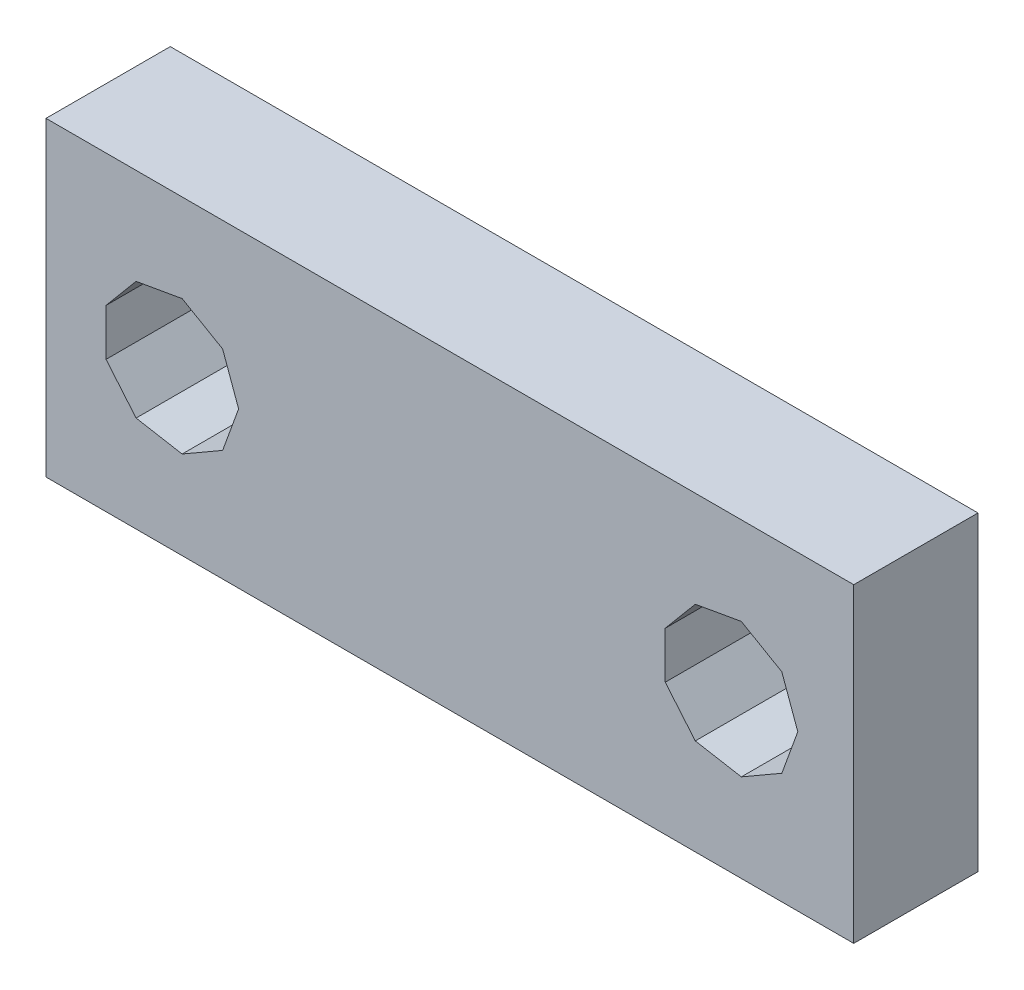
ISO-10303-21;
HEADER;
FILE_DESCRIPTION(('STEP AP214'),'2;1');
FILE_NAME('part.step','',(''),(''),'','','');
FILE_SCHEMA(('AUTOMOTIVE_DESIGN { 1 0 10303 214 1 1 1 1 }'));
ENDSEC;
DATA;
#1=APPLICATION_CONTEXT('core data for automotive mechanical design processes');
#2=APPLICATION_PROTOCOL_DEFINITION('international standard','automotive_design',2000,#1);
#3=PRODUCT_CONTEXT('',#1,'mechanical');
#4=PRODUCT('Part','Part','',(#3));
#5=PRODUCT_RELATED_PRODUCT_CATEGORY('part','',(#4));
#6=PRODUCT_DEFINITION_FORMATION('','',#4);
#7=PRODUCT_DEFINITION_CONTEXT('part definition',#1,'design');
#8=PRODUCT_DEFINITION('design','',#6,#7);
#9=PRODUCT_DEFINITION_SHAPE('','',#8);
#10=(LENGTH_UNIT() NAMED_UNIT(*) SI_UNIT(.MILLI.,.METRE.));
#11=(NAMED_UNIT(*) PLANE_ANGLE_UNIT() SI_UNIT($,.RADIAN.));
#12=(NAMED_UNIT(*) SI_UNIT($,.STERADIAN.) SOLID_ANGLE_UNIT());
#13=UNCERTAINTY_MEASURE_WITH_UNIT(LENGTH_MEASURE(1.E-05),#10,'distance_accuracy_value','');
#14=(GEOMETRIC_REPRESENTATION_CONTEXT(3) GLOBAL_UNCERTAINTY_ASSIGNED_CONTEXT((#13)) GLOBAL_UNIT_ASSIGNED_CONTEXT((#10,
#11,#12)) REPRESENTATION_CONTEXT('',''));
#15=CARTESIAN_POINT('',(0.,0.,0.));
#16=DIRECTION('',(0.,0.,1.));
#17=DIRECTION('',(1.,0.,0.));
#18=AXIS2_PLACEMENT_3D('',#15,#16,#17);
#19=CARTESIAN_POINT('',(0.,0.,4.));
#20=DIRECTION('',(0.,0.,1.));
#21=DIRECTION('',(1.,0.,0.));
#22=AXIS2_PLACEMENT_3D('',#19,#20,#21);
#23=PLANE('',#22);
#24=DIRECTION('',(0.,-1.,0.));
#25=VECTOR('',#24,1.);
#26=CARTESIAN_POINT('',(0.,10.,4.));
#27=LINE('',#26,#25);
#28=CARTESIAN_POINT('',(0.,10.,4.));
#29=VERTEX_POINT('',#28);
#30=CARTESIAN_POINT('',(0.,0.,4.));
#31=VERTEX_POINT('',#30);
#32=EDGE_CURVE('E320',#29,#31,#27,.T.);
#33=ORIENTED_EDGE('',*,*,#32,.T.);
#34=DIRECTION('',(1.,0.,0.));
#35=VECTOR('',#34,1.);
#36=CARTESIAN_POINT('',(0.,0.,4.));
#37=LINE('',#36,#35);
#38=CARTESIAN_POINT('',(26.,0.,4.));
#39=VERTEX_POINT('',#38);
#40=EDGE_CURVE('E323',#31,#39,#37,.T.);
#41=ORIENTED_EDGE('',*,*,#40,.T.);
#42=DIRECTION('',(0.,1.,0.));
#43=VECTOR('',#42,1.);
#44=CARTESIAN_POINT('',(26.,10.,4.));
#45=LINE('',#44,#43);
#46=CARTESIAN_POINT('',(26.,10.,4.));
#47=VERTEX_POINT('',#46);
#48=EDGE_CURVE('E326',#39,#47,#45,.T.);
#49=ORIENTED_EDGE('',*,*,#48,.T.);
#50=DIRECTION('',(-1.,0.,0.));
#51=VECTOR('',#50,1.);
#52=CARTESIAN_POINT('',(0.,10.,4.));
#53=LINE('',#52,#51);
#54=EDGE_CURVE('E328',#47,#29,#53,.T.);
#55=ORIENTED_EDGE('',*,*,#54,.T.);
#56=EDGE_LOOP('',(#33,#41,#49,#55));
#57=FACE_BOUND('',#56,.T.);
#58=DIRECTION('',(0.,-1.,0.));
#59=VECTOR('',#58,1.);
#60=CARTESIAN_POINT('',(1.93267600801389,4.24755567239836,4.));
#61=LINE('',#60,#59);
#62=CARTESIAN_POINT('',(1.93267600801389,5.75244442974977,4.));
#63=VERTEX_POINT('',#62);
#64=CARTESIAN_POINT('',(1.93267600801389,4.24755567239836,4.));
#65=VERTEX_POINT('',#64);
#66=EDGE_CURVE('E256',#63,#65,#61,.T.);
#67=ORIENTED_EDGE('',*,*,#66,.F.);
#68=DIRECTION('',(-0.642787606856775,-0.766044445493432,0.));
#69=VECTOR('',#68,1.);
#70=CARTESIAN_POINT('',(1.93267600801389,5.75244442974977,4.));
#71=LINE('',#70,#69);
#72=CARTESIAN_POINT('',(2.89999985093747,6.90525610340432,4.));
#73=VERTEX_POINT('',#72);
#74=EDGE_CURVE('E254',#73,#63,#71,.T.);
#75=ORIENTED_EDGE('',*,*,#74,.F.);
#76=DIRECTION('',(-0.984807774919369,-0.173648053425202,0.));
#77=VECTOR('',#76,1.);
#78=CARTESIAN_POINT('',(2.89999985093747,6.90525610340432,4.));
#79=LINE('',#78,#77);
#80=CARTESIAN_POINT('',(4.38202599956588,7.16657710673986,4.));
#81=VERTEX_POINT('',#80);
#82=EDGE_CURVE('E272',#81,#73,#79,.T.);
#83=ORIENTED_EDGE('',*,*,#82,.F.);
#84=DIRECTION('',(-0.866025520884857,0.499999797176071,0.));
#85=VECTOR('',#84,1.);
#86=CARTESIAN_POINT('',(4.38202599956588,7.16657710673986,4.));
#87=LINE('',#86,#85);
#88=CARTESIAN_POINT('',(5.68529806952489,6.41413303329161,4.));
#89=VERTEX_POINT('',#88);
#90=EDGE_CURVE('E269',#89,#81,#87,.T.);
#91=ORIENTED_EDGE('',*,*,#90,.F.);
#92=DIRECTION('',(-0.342019920899004,0.939692701742564,0.));
#93=VECTOR('',#92,1.);
#94=CARTESIAN_POINT('',(5.68529806952489,6.41413303329161,4.));
#95=LINE('',#94,#93);
#96=CARTESIAN_POINT('',(6.20000000327602,5.00000005107406,4.));
#97=VERTEX_POINT('',#96);
#98=EDGE_CURVE('E267',#97,#89,#95,.T.);
#99=ORIENTED_EDGE('',*,*,#98,.F.);
#100=DIRECTION('',(0.342019920899004,0.939692701742564,0.));
#101=VECTOR('',#100,1.);
#102=CARTESIAN_POINT('',(6.20000000327602,5.00000005107406,4.));
#103=LINE('',#102,#101);
#104=CARTESIAN_POINT('',(5.68529806952489,3.58586706885652,4.));
#105=VERTEX_POINT('',#104);
#106=EDGE_CURVE('E265',#105,#97,#103,.T.);
#107=ORIENTED_EDGE('',*,*,#106,.F.);
#108=DIRECTION('',(0.866025520884857,0.499999797176071,0.));
#109=VECTOR('',#108,1.);
#110=CARTESIAN_POINT('',(5.68529806952489,3.58586706885652,4.));
#111=LINE('',#110,#109);
#112=CARTESIAN_POINT('',(4.38202599956588,2.83342299540827,4.));
#113=VERTEX_POINT('',#112);
#114=EDGE_CURVE('E263',#113,#105,#111,.T.);
#115=ORIENTED_EDGE('',*,*,#114,.F.);
#116=DIRECTION('',(0.984807774919369,-0.173648053425203,0.));
#117=VECTOR('',#116,1.);
#118=CARTESIAN_POINT('',(4.38202599956588,2.83342299540827,4.));
#119=LINE('',#118,#117);
#120=CARTESIAN_POINT('',(2.89999985093747,3.09474399874381,4.));
#121=VERTEX_POINT('',#120);
#122=EDGE_CURVE('E261',#121,#113,#119,.T.);
#123=ORIENTED_EDGE('',*,*,#122,.F.);
#124=DIRECTION('',(0.642787606856775,-0.766044445493432,0.));
#125=VECTOR('',#124,1.);
#126=CARTESIAN_POINT('',(2.89999985093747,3.09474399874381,4.));
#127=LINE('',#126,#125);
#128=EDGE_CURVE('E259',#65,#121,#127,.T.);
#129=ORIENTED_EDGE('',*,*,#128,.F.);
#130=EDGE_LOOP('',(#67,#75,#83,#91,#99,#107,#115,#123,#129));
#131=FACE_BOUND('',#130,.T.);
#132=DIRECTION('',(0.,-1.,0.));
#133=VECTOR('',#132,1.);
#134=CARTESIAN_POINT('',(19.9326760047203,4.24755567239836,4.));
#135=LINE('',#134,#133);
#136=CARTESIAN_POINT('',(19.9326760047203,5.75244442974977,4.));
#137=VERTEX_POINT('',#136);
#138=CARTESIAN_POINT('',(19.9326760047203,4.24755567239836,4.));
#139=VERTEX_POINT('',#138);
#140=EDGE_CURVE('E190',#137,#139,#135,.T.);
#141=ORIENTED_EDGE('',*,*,#140,.F.);
#142=DIRECTION('',(-0.642787606856775,-0.766044445493432,0.));
#143=VECTOR('',#142,1.);
#144=CARTESIAN_POINT('',(19.9326760047203,5.75244442974977,4.));
#145=LINE('',#144,#143);
#146=CARTESIAN_POINT('',(20.8999998476439,6.90525610340432,4.));
#147=VERTEX_POINT('',#146);
#148=EDGE_CURVE('E182',#147,#137,#145,.T.);
#149=ORIENTED_EDGE('',*,*,#148,.F.);
#150=DIRECTION('',(-0.984807774919369,-0.173648053425202,0.));
#151=VECTOR('',#150,1.);
#152=CARTESIAN_POINT('',(20.8999998476439,6.90525610340432,4.));
#153=LINE('',#152,#151);
#154=CARTESIAN_POINT('',(22.3820259962723,7.16657710673987,4.));
#155=VERTEX_POINT('',#154);
#156=EDGE_CURVE('E217',#155,#147,#153,.T.);
#157=ORIENTED_EDGE('',*,*,#156,.F.);
#158=DIRECTION('',(-0.866025520884857,0.499999797176071,0.));
#159=VECTOR('',#158,1.);
#160=CARTESIAN_POINT('',(22.3820259962723,7.16657710673986,4.));
#161=LINE('',#160,#159);
#162=CARTESIAN_POINT('',(23.6852980662313,6.41413303329161,4.));
#163=VERTEX_POINT('',#162);
#164=EDGE_CURVE('E215',#163,#155,#161,.T.);
#165=ORIENTED_EDGE('',*,*,#164,.F.);
#166=DIRECTION('',(-0.342019920899003,0.939692701742564,0.));
#167=VECTOR('',#166,1.);
#168=CARTESIAN_POINT('',(23.6852980662313,6.41413303329161,4.));
#169=LINE('',#168,#167);
#170=CARTESIAN_POINT('',(24.1999999999825,5.00000005107406,4.));
#171=VERTEX_POINT('',#170);
#172=EDGE_CURVE('E213',#171,#163,#169,.T.);
#173=ORIENTED_EDGE('',*,*,#172,.F.);
#174=DIRECTION('',(0.342019920899002,0.939692701742564,0.));
#175=VECTOR('',#174,1.);
#176=CARTESIAN_POINT('',(24.1999999999825,5.00000005107406,4.));
#177=LINE('',#176,#175);
#178=CARTESIAN_POINT('',(23.6852980662313,3.58586706885652,4.));
#179=VERTEX_POINT('',#178);
#180=EDGE_CURVE('E211',#179,#171,#177,.T.);
#181=ORIENTED_EDGE('',*,*,#180,.F.);
#182=DIRECTION('',(0.866025520884857,0.499999797176071,0.));
#183=VECTOR('',#182,1.);
#184=CARTESIAN_POINT('',(23.6852980662313,3.58586706885652,4.));
#185=LINE('',#184,#183);
#186=CARTESIAN_POINT('',(22.3820259962723,2.83342299540827,4.));
#187=VERTEX_POINT('',#186);
#188=EDGE_CURVE('E209',#187,#179,#185,.T.);
#189=ORIENTED_EDGE('',*,*,#188,.F.);
#190=DIRECTION('',(0.984807774919369,-0.173648053425203,0.));
#191=VECTOR('',#190,1.);
#192=CARTESIAN_POINT('',(22.3820259962723,2.83342299540827,4.));
#193=LINE('',#192,#191);
#194=CARTESIAN_POINT('',(20.8999998476439,3.09474399874381,4.));
#195=VERTEX_POINT('',#194);
#196=EDGE_CURVE('E205',#195,#187,#193,.T.);
#197=ORIENTED_EDGE('',*,*,#196,.F.);
#198=DIRECTION('',(0.642787606856775,-0.766044445493432,0.));
#199=VECTOR('',#198,1.);
#200=CARTESIAN_POINT('',(20.8999998476439,3.09474399874381,4.));
#201=LINE('',#200,#199);
#202=EDGE_CURVE('E203',#139,#195,#201,.T.);
#203=ORIENTED_EDGE('',*,*,#202,.F.);
#204=EDGE_LOOP('',(#141,#149,#157,#165,#173,#181,#189,#197,#203));
#205=FACE_BOUND('',#204,.T.);
#206=ADVANCED_FACE('F33',(#57,#131,#205),#23,.T.);
#207=CARTESIAN_POINT('',(0.,0.,0.));
#208=DIRECTION('',(0.,0.,1.));
#209=DIRECTION('',(1.,0.,0.));
#210=AXIS2_PLACEMENT_3D('',#207,#208,#209);
#211=PLANE('',#210);
#212=DIRECTION('',(-0.642787606856775,-0.766044445493432,0.));
#213=VECTOR('',#212,1.);
#214=CARTESIAN_POINT('',(1.93267600801389,5.75244442974977,0.));
#215=LINE('',#214,#213);
#216=CARTESIAN_POINT('',(2.89999985093747,6.90525610340432,0.));
#217=VERTEX_POINT('',#216);
#218=CARTESIAN_POINT('',(1.93267600801389,5.75244442974977,0.));
#219=VERTEX_POINT('',#218);
#220=EDGE_CURVE('E198',#217,#219,#215,.T.);
#221=ORIENTED_EDGE('',*,*,#220,.T.);
#222=DIRECTION('',(0.,-1.,0.));
#223=VECTOR('',#222,1.);
#224=CARTESIAN_POINT('',(1.93267600801389,4.24755567239836,0.));
#225=LINE('',#224,#223);
#226=CARTESIAN_POINT('',(1.93267600801389,4.24755567239836,0.));
#227=VERTEX_POINT('',#226);
#228=EDGE_CURVE('E277',#219,#227,#225,.T.);
#229=ORIENTED_EDGE('',*,*,#228,.T.);
#230=DIRECTION('',(0.642787606856775,-0.766044445493432,0.));
#231=VECTOR('',#230,1.);
#232=CARTESIAN_POINT('',(2.89999985093747,3.09474399874381,0.));
#233=LINE('',#232,#231);
#234=CARTESIAN_POINT('',(2.89999985093747,3.09474399874381,0.));
#235=VERTEX_POINT('',#234);
#236=EDGE_CURVE('E280',#227,#235,#233,.T.);
#237=ORIENTED_EDGE('',*,*,#236,.T.);
#238=DIRECTION('',(0.984807774919369,-0.173648053425203,0.));
#239=VECTOR('',#238,1.);
#240=CARTESIAN_POINT('',(4.38202599956588,2.83342299540827,0.));
#241=LINE('',#240,#239);
#242=CARTESIAN_POINT('',(4.38202599956588,2.83342299540827,0.));
#243=VERTEX_POINT('',#242);
#244=EDGE_CURVE('E283',#235,#243,#241,.T.);
#245=ORIENTED_EDGE('',*,*,#244,.T.);
#246=DIRECTION('',(0.866025520884857,0.499999797176071,0.));
#247=VECTOR('',#246,1.);
#248=CARTESIAN_POINT('',(5.68529806952489,3.58586706885652,0.));
#249=LINE('',#248,#247);
#250=CARTESIAN_POINT('',(5.68529806952489,3.58586706885652,0.));
#251=VERTEX_POINT('',#250);
#252=EDGE_CURVE('E286',#243,#251,#249,.T.);
#253=ORIENTED_EDGE('',*,*,#252,.T.);
#254=DIRECTION('',(0.342019920899004,0.939692701742564,0.));
#255=VECTOR('',#254,1.);
#256=CARTESIAN_POINT('',(6.20000000327602,5.00000005107406,0.));
#257=LINE('',#256,#255);
#258=CARTESIAN_POINT('',(6.20000000327602,5.00000005107406,0.));
#259=VERTEX_POINT('',#258);
#260=EDGE_CURVE('E289',#251,#259,#257,.T.);
#261=ORIENTED_EDGE('',*,*,#260,.T.);
#262=DIRECTION('',(-0.342019920899004,0.939692701742564,0.));
#263=VECTOR('',#262,1.);
#264=CARTESIAN_POINT('',(5.68529806952489,6.41413303329161,0.));
#265=LINE('',#264,#263);
#266=CARTESIAN_POINT('',(5.68529806952489,6.41413303329161,0.));
#267=VERTEX_POINT('',#266);
#268=EDGE_CURVE('E292',#259,#267,#265,.T.);
#269=ORIENTED_EDGE('',*,*,#268,.T.);
#270=DIRECTION('',(-0.866025520884857,0.499999797176071,0.));
#271=VECTOR('',#270,1.);
#272=CARTESIAN_POINT('',(4.38202599956588,7.16657710673986,0.));
#273=LINE('',#272,#271);
#274=CARTESIAN_POINT('',(4.38202599956588,7.16657710673986,0.));
#275=VERTEX_POINT('',#274);
#276=EDGE_CURVE('E295',#267,#275,#273,.T.);
#277=ORIENTED_EDGE('',*,*,#276,.T.);
#278=DIRECTION('',(-0.984807774919369,-0.173648053425202,0.));
#279=VECTOR('',#278,1.);
#280=CARTESIAN_POINT('',(2.89999985093747,6.90525610340432,0.));
#281=LINE('',#280,#279);
#282=EDGE_CURVE('E257',#275,#217,#281,.T.);
#283=ORIENTED_EDGE('',*,*,#282,.T.);
#284=EDGE_LOOP('',(#221,#229,#237,#245,#253,#261,#269,#277,#283));
#285=FACE_BOUND('',#284,.T.);
#286=DIRECTION('',(0.,-1.,0.));
#287=VECTOR('',#286,1.);
#288=CARTESIAN_POINT('',(0.,10.,0.));
#289=LINE('',#288,#287);
#290=CARTESIAN_POINT('',(0.,10.,0.));
#291=VERTEX_POINT('',#290);
#292=CARTESIAN_POINT('',(0.,0.,0.));
#293=VERTEX_POINT('',#292);
#294=EDGE_CURVE('E319',#291,#293,#289,.T.);
#295=ORIENTED_EDGE('',*,*,#294,.F.);
#296=DIRECTION('',(-1.,0.,0.));
#297=VECTOR('',#296,1.);
#298=CARTESIAN_POINT('',(0.,10.,0.));
#299=LINE('',#298,#297);
#300=CARTESIAN_POINT('',(26.,10.,0.));
#301=VERTEX_POINT('',#300);
#302=EDGE_CURVE('E324',#301,#291,#299,.T.);
#303=ORIENTED_EDGE('',*,*,#302,.F.);
#304=DIRECTION('',(0.,1.,0.));
#305=VECTOR('',#304,1.);
#306=CARTESIAN_POINT('',(26.,10.,0.));
#307=LINE('',#306,#305);
#308=CARTESIAN_POINT('',(26.,0.,0.));
#309=VERTEX_POINT('',#308);
#310=EDGE_CURVE('E335',#309,#301,#307,.T.);
#311=ORIENTED_EDGE('',*,*,#310,.F.);
#312=DIRECTION('',(1.,0.,0.));
#313=VECTOR('',#312,1.);
#314=CARTESIAN_POINT('',(0.,0.,0.));
#315=LINE('',#314,#313);
#316=EDGE_CURVE('E333',#293,#309,#315,.T.);
#317=ORIENTED_EDGE('',*,*,#316,.F.);
#318=EDGE_LOOP('',(#295,#303,#311,#317));
#319=FACE_BOUND('',#318,.T.);
#320=DIRECTION('',(-0.642787606856775,-0.766044445493432,0.));
#321=VECTOR('',#320,1.);
#322=CARTESIAN_POINT('',(19.9326760047203,5.75244442974977,0.));
#323=LINE('',#322,#321);
#324=CARTESIAN_POINT('',(20.8999998476439,6.90525610340432,0.));
#325=VERTEX_POINT('',#324);
#326=CARTESIAN_POINT('',(19.9326760047203,5.75244442974977,0.));
#327=VERTEX_POINT('',#326);
#328=EDGE_CURVE('E56',#325,#327,#323,.T.);
#329=ORIENTED_EDGE('',*,*,#328,.T.);
#330=DIRECTION('',(0.,-1.,0.));
#331=VECTOR('',#330,1.);
#332=CARTESIAN_POINT('',(19.9326760047203,4.24755567239836,0.));
#333=LINE('',#332,#331);
#334=CARTESIAN_POINT('',(19.9326760047203,4.24755567239836,0.));
#335=VERTEX_POINT('',#334);
#336=EDGE_CURVE('E197',#327,#335,#333,.T.);
#337=ORIENTED_EDGE('',*,*,#336,.T.);
#338=DIRECTION('',(0.642787606856775,-0.766044445493432,0.));
#339=VECTOR('',#338,1.);
#340=CARTESIAN_POINT('',(20.8999998476439,3.09474399874381,0.));
#341=LINE('',#340,#339);
#342=CARTESIAN_POINT('',(20.8999998476439,3.09474399874381,0.));
#343=VERTEX_POINT('',#342);
#344=EDGE_CURVE('E221',#335,#343,#341,.T.);
#345=ORIENTED_EDGE('',*,*,#344,.T.);
#346=DIRECTION('',(0.984807774919369,-0.173648053425203,0.));
#347=VECTOR('',#346,1.);
#348=CARTESIAN_POINT('',(22.3820259962723,2.83342299540827,0.));
#349=LINE('',#348,#347);
#350=CARTESIAN_POINT('',(22.3820259962723,2.83342299540827,0.));
#351=VERTEX_POINT('',#350);
#352=EDGE_CURVE('E224',#343,#351,#349,.T.);
#353=ORIENTED_EDGE('',*,*,#352,.T.);
#354=DIRECTION('',(0.866025520884857,0.499999797176071,0.));
#355=VECTOR('',#354,1.);
#356=CARTESIAN_POINT('',(23.6852980662313,3.58586706885652,0.));
#357=LINE('',#356,#355);
#358=CARTESIAN_POINT('',(23.6852980662313,3.58586706885652,0.));
#359=VERTEX_POINT('',#358);
#360=EDGE_CURVE('E227',#351,#359,#357,.T.);
#361=ORIENTED_EDGE('',*,*,#360,.T.);
#362=DIRECTION('',(0.342019920899002,0.939692701742564,0.));
#363=VECTOR('',#362,1.);
#364=CARTESIAN_POINT('',(24.1999999999825,5.00000005107406,0.));
#365=LINE('',#364,#363);
#366=CARTESIAN_POINT('',(24.1999999999825,5.00000005107406,0.));
#367=VERTEX_POINT('',#366);
#368=EDGE_CURVE('E230',#359,#367,#365,.T.);
#369=ORIENTED_EDGE('',*,*,#368,.T.);
#370=DIRECTION('',(-0.342019920899003,0.939692701742564,0.));
#371=VECTOR('',#370,1.);
#372=CARTESIAN_POINT('',(23.6852980662313,6.41413303329161,0.));
#373=LINE('',#372,#371);
#374=CARTESIAN_POINT('',(23.6852980662313,6.41413303329161,0.));
#375=VERTEX_POINT('',#374);
#376=EDGE_CURVE('E233',#367,#375,#373,.T.);
#377=ORIENTED_EDGE('',*,*,#376,.T.);
#378=DIRECTION('',(-0.866025520884857,0.499999797176071,0.));
#379=VECTOR('',#378,1.);
#380=CARTESIAN_POINT('',(22.3820259962723,7.16657710673986,0.));
#381=LINE('',#380,#379);
#382=CARTESIAN_POINT('',(22.3820259962723,7.16657710673986,0.));
#383=VERTEX_POINT('',#382);
#384=EDGE_CURVE('E236',#375,#383,#381,.T.);
#385=ORIENTED_EDGE('',*,*,#384,.T.);
#386=DIRECTION('',(-0.984807774919369,-0.173648053425202,0.));
#387=VECTOR('',#386,1.);
#388=CARTESIAN_POINT('',(20.8999998476439,6.90525610340432,0.));
#389=LINE('',#388,#387);
#390=EDGE_CURVE('E191',#383,#325,#389,.T.);
#391=ORIENTED_EDGE('',*,*,#390,.T.);
#392=EDGE_LOOP('',(#329,#337,#345,#353,#361,#369,#377,#385,#391));
#393=FACE_BOUND('',#392,.T.);
#394=ADVANCED_FACE('F353',(#285,#319,#393),#211,.F.);
#395=CARTESIAN_POINT('',(0.,10.,4.));
#396=DIRECTION('',(1.,0.,0.));
#397=DIRECTION('',(0.,0.,-1.));
#398=AXIS2_PLACEMENT_3D('',#395,#396,#397);
#399=PLANE('',#398);
#400=ORIENTED_EDGE('',*,*,#294,.T.);
#401=DIRECTION('',(0.,0.,-1.));
#402=VECTOR('',#401,1.);
#403=CARTESIAN_POINT('',(0.,0.,4.));
#404=LINE('',#403,#402);
#405=EDGE_CURVE('E11',#31,#293,#404,.T.);
#406=ORIENTED_EDGE('',*,*,#405,.F.);
#407=ORIENTED_EDGE('',*,*,#32,.F.);
#408=DIRECTION('',(0.,0.,-1.));
#409=VECTOR('',#408,1.);
#410=CARTESIAN_POINT('',(0.,10.,4.));
#411=LINE('',#410,#409);
#412=EDGE_CURVE('E330',#29,#291,#411,.T.);
#413=ORIENTED_EDGE('',*,*,#412,.T.);
#414=EDGE_LOOP('',(#400,#406,#407,#413));
#415=FACE_BOUND('',#414,.T.);
#416=ADVANCED_FACE('F35',(#415),#399,.F.);
#417=CARTESIAN_POINT('',(0.,0.,4.));
#418=DIRECTION('',(0.,1.,0.));
#419=DIRECTION('',(0.,0.,1.));
#420=AXIS2_PLACEMENT_3D('',#417,#418,#419);
#421=PLANE('',#420);
#422=ORIENTED_EDGE('',*,*,#316,.T.);
#423=DIRECTION('',(0.,0.,-1.));
#424=VECTOR('',#423,1.);
#425=CARTESIAN_POINT('',(26.,0.,4.));
#426=LINE('',#425,#424);
#427=EDGE_CURVE('E41',#39,#309,#426,.T.);
#428=ORIENTED_EDGE('',*,*,#427,.F.);
#429=ORIENTED_EDGE('',*,*,#40,.F.);
#430=ORIENTED_EDGE('',*,*,#405,.T.);
#431=EDGE_LOOP('',(#422,#428,#429,#430));
#432=FACE_BOUND('',#431,.T.);
#433=ADVANCED_FACE('F364',(#432),#421,.F.);
#434=CARTESIAN_POINT('',(26.,10.,4.));
#435=DIRECTION('',(-1.,0.,0.));
#436=DIRECTION('',(0.,0.,1.));
#437=AXIS2_PLACEMENT_3D('',#434,#435,#436);
#438=PLANE('',#437);
#439=ORIENTED_EDGE('',*,*,#310,.T.);
#440=DIRECTION('',(0.,0.,-1.));
#441=VECTOR('',#440,1.);
#442=CARTESIAN_POINT('',(26.,10.,4.));
#443=LINE('',#442,#441);
#444=EDGE_CURVE('E340',#47,#301,#443,.T.);
#445=ORIENTED_EDGE('',*,*,#444,.F.);
#446=ORIENTED_EDGE('',*,*,#48,.F.);
#447=ORIENTED_EDGE('',*,*,#427,.T.);
#448=EDGE_LOOP('',(#439,#445,#446,#447));
#449=FACE_BOUND('',#448,.T.);
#450=ADVANCED_FACE('F347',(#449),#438,.F.);
#451=CARTESIAN_POINT('',(0.,10.,4.));
#452=DIRECTION('',(0.,-1.,0.));
#453=DIRECTION('',(0.,0.,-1.));
#454=AXIS2_PLACEMENT_3D('',#451,#452,#453);
#455=PLANE('',#454);
#456=ORIENTED_EDGE('',*,*,#302,.T.);
#457=ORIENTED_EDGE('',*,*,#412,.F.);
#458=ORIENTED_EDGE('',*,*,#54,.F.);
#459=ORIENTED_EDGE('',*,*,#444,.T.);
#460=EDGE_LOOP('',(#456,#457,#458,#459));
#461=FACE_BOUND('',#460,.T.);
#462=ADVANCED_FACE('F357',(#461),#455,.F.);
#463=CARTESIAN_POINT('',(1.93267600801389,5.75244442974977,4.));
#464=DIRECTION('',(0.766044445493432,-0.642787606856775,0.));
#465=DIRECTION('',(0.642787606856775,0.766044445493432,0.));
#466=AXIS2_PLACEMENT_3D('',#463,#464,#465);
#467=PLANE('',#466);
#468=ORIENTED_EDGE('',*,*,#220,.F.);
#469=DIRECTION('',(0.,0.,-1.));
#470=VECTOR('',#469,1.);
#471=CARTESIAN_POINT('',(2.89999985093747,6.90525610340432,4.));
#472=LINE('',#471,#470);
#473=EDGE_CURVE('E274',#73,#217,#472,.T.);
#474=ORIENTED_EDGE('',*,*,#473,.F.);
#475=ORIENTED_EDGE('',*,*,#74,.T.);
#476=DIRECTION('',(0.,0.,-1.));
#477=VECTOR('',#476,1.);
#478=CARTESIAN_POINT('',(1.93267600801389,5.75244442974977,4.));
#479=LINE('',#478,#477);
#480=EDGE_CURVE('E316',#63,#219,#479,.T.);
#481=ORIENTED_EDGE('',*,*,#480,.T.);
#482=EDGE_LOOP('',(#468,#474,#475,#481));
#483=FACE_BOUND('',#482,.T.);
#484=ADVANCED_FACE('F379',(#483),#467,.T.);
#485=CARTESIAN_POINT('',(1.93267600801389,4.24755567239836,4.));
#486=DIRECTION('',(1.,0.,0.));
#487=DIRECTION('',(0.,1.,0.));
#488=AXIS2_PLACEMENT_3D('',#485,#486,#487);
#489=PLANE('',#488);
#490=ORIENTED_EDGE('',*,*,#228,.F.);
#491=ORIENTED_EDGE('',*,*,#480,.F.);
#492=ORIENTED_EDGE('',*,*,#66,.T.);
#493=DIRECTION('',(0.,0.,-1.));
#494=VECTOR('',#493,1.);
#495=CARTESIAN_POINT('',(1.93267600801389,4.24755567239836,4.));
#496=LINE('',#495,#494);
#497=EDGE_CURVE('E314',#65,#227,#496,.T.);
#498=ORIENTED_EDGE('',*,*,#497,.T.);
#499=EDGE_LOOP('',(#490,#491,#492,#498));
#500=FACE_BOUND('',#499,.T.);
#501=ADVANCED_FACE('F386',(#500),#489,.T.);
#502=CARTESIAN_POINT('',(2.89999985093747,3.09474399874381,4.));
#503=DIRECTION('',(0.766044445493432,0.642787606856775,0.));
#504=DIRECTION('',(-0.642787606856775,0.766044445493432,0.));
#505=AXIS2_PLACEMENT_3D('',#502,#503,#504);
#506=PLANE('',#505);
#507=ORIENTED_EDGE('',*,*,#236,.F.);
#508=ORIENTED_EDGE('',*,*,#497,.F.);
#509=ORIENTED_EDGE('',*,*,#128,.T.);
#510=DIRECTION('',(0.,0.,-1.));
#511=VECTOR('',#510,1.);
#512=CARTESIAN_POINT('',(2.89999985093747,3.09474399874381,4.));
#513=LINE('',#512,#511);
#514=EDGE_CURVE('E312',#121,#235,#513,.T.);
#515=ORIENTED_EDGE('',*,*,#514,.T.);
#516=EDGE_LOOP('',(#507,#508,#509,#515));
#517=FACE_BOUND('',#516,.T.);
#518=ADVANCED_FACE('F391',(#517),#506,.T.);
#519=CARTESIAN_POINT('',(4.38202599956588,2.83342299540827,4.));
#520=DIRECTION('',(0.173648053425203,0.984807774919369,0.));
#521=DIRECTION('',(-0.984807774919369,0.173648053425203,0.));
#522=AXIS2_PLACEMENT_3D('',#519,#520,#521);
#523=PLANE('',#522);
#524=ORIENTED_EDGE('',*,*,#244,.F.);
#525=ORIENTED_EDGE('',*,*,#514,.F.);
#526=ORIENTED_EDGE('',*,*,#122,.T.);
#527=DIRECTION('',(0.,0.,-1.));
#528=VECTOR('',#527,1.);
#529=CARTESIAN_POINT('',(4.38202599956588,2.83342299540827,4.));
#530=LINE('',#529,#528);
#531=EDGE_CURVE('E310',#113,#243,#530,.T.);
#532=ORIENTED_EDGE('',*,*,#531,.T.);
#533=EDGE_LOOP('',(#524,#525,#526,#532));
#534=FACE_BOUND('',#533,.T.);
#535=ADVANCED_FACE('F416',(#534),#523,.T.);
#536=CARTESIAN_POINT('',(5.68529806952489,3.58586706885652,4.));
#537=DIRECTION('',(-0.499999797176071,0.866025520884857,0.));
#538=DIRECTION('',(-0.866025520884857,-0.499999797176071,0.));
#539=AXIS2_PLACEMENT_3D('',#536,#537,#538);
#540=PLANE('',#539);
#541=ORIENTED_EDGE('',*,*,#252,.F.);
#542=ORIENTED_EDGE('',*,*,#531,.F.);
#543=ORIENTED_EDGE('',*,*,#114,.T.);
#544=DIRECTION('',(0.,0.,-1.));
#545=VECTOR('',#544,1.);
#546=CARTESIAN_POINT('',(5.68529806952489,3.58586706885652,4.));
#547=LINE('',#546,#545);
#548=EDGE_CURVE('E308',#105,#251,#547,.T.);
#549=ORIENTED_EDGE('',*,*,#548,.T.);
#550=EDGE_LOOP('',(#541,#542,#543,#549));
#551=FACE_BOUND('',#550,.T.);
#552=ADVANCED_FACE('F421',(#551),#540,.T.);
#553=CARTESIAN_POINT('',(6.20000000327602,5.00000005107406,4.));
#554=DIRECTION('',(-0.939692701742564,0.342019920899004,0.));
#555=DIRECTION('',(-0.342019920899004,-0.939692701742564,0.));
#556=AXIS2_PLACEMENT_3D('',#553,#554,#555);
#557=PLANE('',#556);
#558=ORIENTED_EDGE('',*,*,#260,.F.);
#559=ORIENTED_EDGE('',*,*,#548,.F.);
#560=ORIENTED_EDGE('',*,*,#106,.T.);
#561=DIRECTION('',(0.,0.,-1.));
#562=VECTOR('',#561,1.);
#563=CARTESIAN_POINT('',(6.20000000327602,5.00000005107406,4.));
#564=LINE('',#563,#562);
#565=EDGE_CURVE('E306',#97,#259,#564,.T.);
#566=ORIENTED_EDGE('',*,*,#565,.T.);
#567=EDGE_LOOP('',(#558,#559,#560,#566));
#568=FACE_BOUND('',#567,.T.);
#569=ADVANCED_FACE('F425',(#568),#557,.T.);
#570=CARTESIAN_POINT('',(5.68529806952489,6.41413303329161,4.));
#571=DIRECTION('',(-0.939692701742564,-0.342019920899004,0.));
#572=DIRECTION('',(0.342019920899004,-0.939692701742564,0.));
#573=AXIS2_PLACEMENT_3D('',#570,#571,#572);
#574=PLANE('',#573);
#575=ORIENTED_EDGE('',*,*,#268,.F.);
#576=ORIENTED_EDGE('',*,*,#565,.F.);
#577=ORIENTED_EDGE('',*,*,#98,.T.);
#578=DIRECTION('',(0.,0.,-1.));
#579=VECTOR('',#578,1.);
#580=CARTESIAN_POINT('',(5.68529806952489,6.41413303329161,4.));
#581=LINE('',#580,#579);
#582=EDGE_CURVE('E304',#89,#267,#581,.T.);
#583=ORIENTED_EDGE('',*,*,#582,.T.);
#584=EDGE_LOOP('',(#575,#576,#577,#583));
#585=FACE_BOUND('',#584,.T.);
#586=ADVANCED_FACE('F429',(#585),#574,.T.);
#587=CARTESIAN_POINT('',(4.38202599956588,7.16657710673986,4.));
#588=DIRECTION('',(-0.499999797176071,-0.866025520884857,0.));
#589=DIRECTION('',(0.866025520884857,-0.499999797176071,0.));
#590=AXIS2_PLACEMENT_3D('',#587,#588,#589);
#591=PLANE('',#590);
#592=ORIENTED_EDGE('',*,*,#276,.F.);
#593=ORIENTED_EDGE('',*,*,#582,.F.);
#594=ORIENTED_EDGE('',*,*,#90,.T.);
#595=DIRECTION('',(0.,0.,-1.));
#596=VECTOR('',#595,1.);
#597=CARTESIAN_POINT('',(4.38202599956588,7.16657710673986,4.));
#598=LINE('',#597,#596);
#599=EDGE_CURVE('E302',#81,#275,#598,.T.);
#600=ORIENTED_EDGE('',*,*,#599,.T.);
#601=EDGE_LOOP('',(#592,#593,#594,#600));
#602=FACE_BOUND('',#601,.T.);
#603=ADVANCED_FACE('F404',(#602),#591,.T.);
#604=CARTESIAN_POINT('',(2.89999985093747,6.90525610340432,4.));
#605=DIRECTION('',(0.173648053425202,-0.984807774919369,0.));
#606=DIRECTION('',(0.984807774919369,0.173648053425202,0.));
#607=AXIS2_PLACEMENT_3D('',#604,#605,#606);
#608=PLANE('',#607);
#609=ORIENTED_EDGE('',*,*,#282,.F.);
#610=ORIENTED_EDGE('',*,*,#599,.F.);
#611=ORIENTED_EDGE('',*,*,#82,.T.);
#612=ORIENTED_EDGE('',*,*,#473,.T.);
#613=EDGE_LOOP('',(#609,#610,#611,#612));
#614=FACE_BOUND('',#613,.T.);
#615=ADVANCED_FACE('F398',(#614),#608,.T.);
#616=CARTESIAN_POINT('',(19.9326760047203,5.75244442974977,4.));
#617=DIRECTION('',(0.766044445493432,-0.642787606856775,0.));
#618=DIRECTION('',(0.642787606856775,0.766044445493432,0.));
#619=AXIS2_PLACEMENT_3D('',#616,#617,#618);
#620=PLANE('',#619);
#621=ORIENTED_EDGE('',*,*,#328,.F.);
#622=DIRECTION('',(0.,0.,-1.));
#623=VECTOR('',#622,1.);
#624=CARTESIAN_POINT('',(20.8999998476439,6.90525610340432,4.));
#625=LINE('',#624,#623);
#626=EDGE_CURVE('E186',#147,#325,#625,.T.);
#627=ORIENTED_EDGE('',*,*,#626,.F.);
#628=ORIENTED_EDGE('',*,*,#148,.T.);
#629=DIRECTION('',(0.,0.,-1.));
#630=VECTOR('',#629,1.);
#631=CARTESIAN_POINT('',(19.9326760047203,5.75244442974977,4.));
#632=LINE('',#631,#630);
#633=EDGE_CURVE('E185',#137,#327,#632,.T.);
#634=ORIENTED_EDGE('',*,*,#633,.T.);
#635=EDGE_LOOP('',(#621,#627,#628,#634));
#636=FACE_BOUND('',#635,.T.);
#637=ADVANCED_FACE('F184',(#636),#620,.T.);
#638=CARTESIAN_POINT('',(19.9326760047203,4.24755567239836,4.));
#639=DIRECTION('',(1.,0.,0.));
#640=DIRECTION('',(0.,0.,-1.));
#641=AXIS2_PLACEMENT_3D('',#638,#639,#640);
#642=PLANE('',#641);
#643=ORIENTED_EDGE('',*,*,#336,.F.);
#644=ORIENTED_EDGE('',*,*,#633,.F.);
#645=ORIENTED_EDGE('',*,*,#140,.T.);
#646=DIRECTION('',(0.,0.,-1.));
#647=VECTOR('',#646,1.);
#648=CARTESIAN_POINT('',(19.9326760047203,4.24755567239836,4.));
#649=LINE('',#648,#647);
#650=EDGE_CURVE('E199',#139,#335,#649,.T.);
#651=ORIENTED_EDGE('',*,*,#650,.T.);
#652=EDGE_LOOP('',(#643,#644,#645,#651));
#653=FACE_BOUND('',#652,.T.);
#654=ADVANCED_FACE('F194',(#653),#642,.T.);
#655=CARTESIAN_POINT('',(20.8999998476439,3.09474399874381,4.));
#656=DIRECTION('',(0.766044445493432,0.642787606856775,0.));
#657=DIRECTION('',(-0.642787606856775,0.766044445493432,0.));
#658=AXIS2_PLACEMENT_3D('',#655,#656,#657);
#659=PLANE('',#658);
#660=ORIENTED_EDGE('',*,*,#344,.F.);
#661=ORIENTED_EDGE('',*,*,#650,.F.);
#662=ORIENTED_EDGE('',*,*,#202,.T.);
#663=DIRECTION('',(0.,0.,-1.));
#664=VECTOR('',#663,1.);
#665=CARTESIAN_POINT('',(20.8999998476439,3.09474399874381,4.));
#666=LINE('',#665,#664);
#667=EDGE_CURVE('E251',#195,#343,#666,.T.);
#668=ORIENTED_EDGE('',*,*,#667,.T.);
#669=EDGE_LOOP('',(#660,#661,#662,#668));
#670=FACE_BOUND('',#669,.T.);
#671=ADVANCED_FACE('F495',(#670),#659,.T.);
#672=CARTESIAN_POINT('',(22.3820259962723,2.83342299540827,4.));
#673=DIRECTION('',(0.173648053425203,0.984807774919369,0.));
#674=DIRECTION('',(-0.984807774919369,0.173648053425203,0.));
#675=AXIS2_PLACEMENT_3D('',#672,#673,#674);
#676=PLANE('',#675);
#677=ORIENTED_EDGE('',*,*,#352,.F.);
#678=ORIENTED_EDGE('',*,*,#667,.F.);
#679=ORIENTED_EDGE('',*,*,#196,.T.);
#680=DIRECTION('',(0.,0.,-1.));
#681=VECTOR('',#680,1.);
#682=CARTESIAN_POINT('',(22.3820259962723,2.83342299540827,4.));
#683=LINE('',#682,#681);
#684=EDGE_CURVE('E249',#187,#351,#683,.T.);
#685=ORIENTED_EDGE('',*,*,#684,.T.);
#686=EDGE_LOOP('',(#677,#678,#679,#685));
#687=FACE_BOUND('',#686,.T.);
#688=ADVANCED_FACE('F504',(#687),#676,.T.);
#689=CARTESIAN_POINT('',(23.6852980662313,3.58586706885652,4.));
#690=DIRECTION('',(-0.49999979717607,0.866025520884857,0.));
#691=DIRECTION('',(-0.866025520884857,-0.49999979717607,0.));
#692=AXIS2_PLACEMENT_3D('',#689,#690,#691);
#693=PLANE('',#692);
#694=ORIENTED_EDGE('',*,*,#360,.F.);
#695=ORIENTED_EDGE('',*,*,#684,.F.);
#696=ORIENTED_EDGE('',*,*,#188,.T.);
#697=DIRECTION('',(0.,0.,-1.));
#698=VECTOR('',#697,1.);
#699=CARTESIAN_POINT('',(23.6852980662313,3.58586706885652,4.));
#700=LINE('',#699,#698);
#701=EDGE_CURVE('E247',#179,#359,#700,.T.);
#702=ORIENTED_EDGE('',*,*,#701,.T.);
#703=EDGE_LOOP('',(#694,#695,#696,#702));
#704=FACE_BOUND('',#703,.T.);
#705=ADVANCED_FACE('F514',(#704),#693,.T.);
#706=CARTESIAN_POINT('',(24.1999999999825,5.00000005107406,4.));
#707=DIRECTION('',(-0.939692701742565,0.342019920899002,0.));
#708=DIRECTION('',(-0.342019920899002,-0.939692701742564,0.));
#709=AXIS2_PLACEMENT_3D('',#706,#707,#708);
#710=PLANE('',#709);
#711=ORIENTED_EDGE('',*,*,#368,.F.);
#712=ORIENTED_EDGE('',*,*,#701,.F.);
#713=ORIENTED_EDGE('',*,*,#180,.T.);
#714=DIRECTION('',(0.,0.,-1.));
#715=VECTOR('',#714,1.);
#716=CARTESIAN_POINT('',(24.1999999999825,5.00000005107406,4.));
#717=LINE('',#716,#715);
#718=EDGE_CURVE('E245',#171,#367,#717,.T.);
#719=ORIENTED_EDGE('',*,*,#718,.T.);
#720=EDGE_LOOP('',(#711,#712,#713,#719));
#721=FACE_BOUND('',#720,.T.);
#722=ADVANCED_FACE('F524',(#721),#710,.T.);
#723=CARTESIAN_POINT('',(23.6852980662313,6.41413303329161,4.));
#724=DIRECTION('',(-0.939692701742564,-0.342019920899003,0.));
#725=DIRECTION('',(0.342019920899003,-0.939692701742564,0.));
#726=AXIS2_PLACEMENT_3D('',#723,#724,#725);
#727=PLANE('',#726);
#728=ORIENTED_EDGE('',*,*,#376,.F.);
#729=ORIENTED_EDGE('',*,*,#718,.F.);
#730=ORIENTED_EDGE('',*,*,#172,.T.);
#731=DIRECTION('',(0.,0.,-1.));
#732=VECTOR('',#731,1.);
#733=CARTESIAN_POINT('',(23.6852980662313,6.41413303329161,4.));
#734=LINE('',#733,#732);
#735=EDGE_CURVE('E243',#163,#375,#734,.T.);
#736=ORIENTED_EDGE('',*,*,#735,.T.);
#737=EDGE_LOOP('',(#728,#729,#730,#736));
#738=FACE_BOUND('',#737,.T.);
#739=ADVANCED_FACE('F534',(#738),#727,.T.);
#740=CARTESIAN_POINT('',(22.3820259962723,7.16657710673986,4.));
#741=DIRECTION('',(-0.499999797176071,-0.866025520884857,0.));
#742=DIRECTION('',(0.866025520884857,-0.499999797176071,0.));
#743=AXIS2_PLACEMENT_3D('',#740,#741,#742);
#744=PLANE('',#743);
#745=ORIENTED_EDGE('',*,*,#384,.F.);
#746=ORIENTED_EDGE('',*,*,#735,.F.);
#747=ORIENTED_EDGE('',*,*,#164,.T.);
#748=DIRECTION('',(0.,0.,-1.));
#749=VECTOR('',#748,1.);
#750=CARTESIAN_POINT('',(22.3820259962723,7.16657710673986,4.));
#751=LINE('',#750,#749);
#752=EDGE_CURVE('E48',#155,#383,#751,.T.);
#753=ORIENTED_EDGE('',*,*,#752,.T.);
#754=EDGE_LOOP('',(#745,#746,#747,#753));
#755=FACE_BOUND('',#754,.T.);
#756=ADVANCED_FACE('F544',(#755),#744,.T.);
#757=CARTESIAN_POINT('',(20.8999998476439,6.90525610340432,4.));
#758=DIRECTION('',(0.173648053425202,-0.984807774919369,0.));
#759=DIRECTION('',(0.984807774919369,0.173648053425202,0.));
#760=AXIS2_PLACEMENT_3D('',#757,#758,#759);
#761=PLANE('',#760);
#762=ORIENTED_EDGE('',*,*,#390,.F.);
#763=ORIENTED_EDGE('',*,*,#752,.F.);
#764=ORIENTED_EDGE('',*,*,#156,.T.);
#765=ORIENTED_EDGE('',*,*,#626,.T.);
#766=EDGE_LOOP('',(#762,#763,#764,#765));
#767=FACE_BOUND('',#766,.T.);
#768=ADVANCED_FACE('F554',(#767),#761,.T.);
#769=CLOSED_SHELL('',(#206,#394,#416,#433,#450,#462,#484,#501,#518,#535,#552,#569,#586,#603,
#615,#637,#654,#671,#688,#705,#722,#739,#756,#768));
#770=MANIFOLD_SOLID_BREP('B2',#769);
#771=ADVANCED_BREP_SHAPE_REPRESENTATION('',(#18,#770),#14);
#772=SHAPE_DEFINITION_REPRESENTATION(#9,#771);
ENDSEC;
END-ISO-10303-21;
